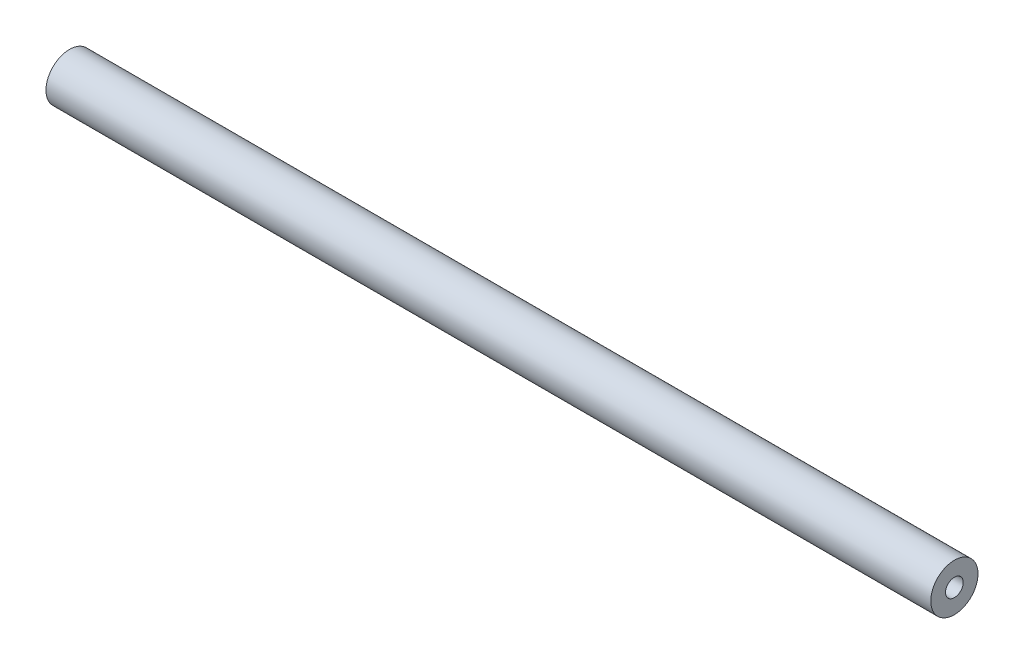
ISO-10303-21;
HEADER;
FILE_DESCRIPTION(('STEP AP214'),'2;1');
FILE_NAME('part.step','',(''),(''),'','','');
FILE_SCHEMA(('AUTOMOTIVE_DESIGN { 1 0 10303 214 1 1 1 1 }'));
ENDSEC;
DATA;
#1=APPLICATION_CONTEXT('core data for automotive mechanical design processes');
#2=APPLICATION_PROTOCOL_DEFINITION('international standard','automotive_design',2000,#1);
#3=PRODUCT_CONTEXT('',#1,'mechanical');
#4=PRODUCT('Part','Part','',(#3));
#5=PRODUCT_RELATED_PRODUCT_CATEGORY('part','',(#4));
#6=PRODUCT_DEFINITION_FORMATION('','',#4);
#7=PRODUCT_DEFINITION_CONTEXT('part definition',#1,'design');
#8=PRODUCT_DEFINITION('design','',#6,#7);
#9=PRODUCT_DEFINITION_SHAPE('','',#8);
#10=(LENGTH_UNIT() NAMED_UNIT(*) SI_UNIT(.MILLI.,.METRE.));
#11=(NAMED_UNIT(*) PLANE_ANGLE_UNIT() SI_UNIT($,.RADIAN.));
#12=(NAMED_UNIT(*) SI_UNIT($,.STERADIAN.) SOLID_ANGLE_UNIT());
#13=UNCERTAINTY_MEASURE_WITH_UNIT(LENGTH_MEASURE(1.E-05),#10,'distance_accuracy_value','');
#14=(GEOMETRIC_REPRESENTATION_CONTEXT(3) GLOBAL_UNCERTAINTY_ASSIGNED_CONTEXT((#13)) GLOBAL_UNIT_ASSIGNED_CONTEXT((#10,
#11,#12)) REPRESENTATION_CONTEXT('',''));
#15=CARTESIAN_POINT('',(0.,0.,0.));
#16=DIRECTION('',(0.,0.,1.));
#17=DIRECTION('',(1.,0.,0.));
#18=AXIS2_PLACEMENT_3D('',#15,#16,#17);
#19=CARTESIAN_POINT('',(0.,0.,0.));
#20=DIRECTION('',(1.,0.,0.));
#21=DIRECTION('',(0.,0.,-1.));
#22=AXIS2_PLACEMENT_3D('',#19,#20,#21);
#23=CYLINDRICAL_SURFACE('',#22,1.5);
#24=CARTESIAN_POINT('',(149.86,0.,0.));
#25=DIRECTION('',(1.,0.,0.));
#26=DIRECTION('',(0.,0.,-1.));
#27=AXIS2_PLACEMENT_3D('',#24,#25,#26);
#28=CIRCLE('',#27,1.5);
#29=CARTESIAN_POINT('',(149.86,0.,-1.5));
#30=VERTEX_POINT('',#29);
#31=EDGE_CURVE('E19',#30,#30,#28,.F.);
#32=ORIENTED_EDGE('',*,*,#31,.F.);
#33=EDGE_LOOP('',(#32));
#34=FACE_BOUND('',#33,.T.);
#35=CARTESIAN_POINT('',(0.,0.,0.));
#36=DIRECTION('',(1.,0.,0.));
#37=DIRECTION('',(0.,0.,-1.));
#38=AXIS2_PLACEMENT_3D('',#35,#36,#37);
#39=CIRCLE('',#38,1.5);
#40=CARTESIAN_POINT('',(0.,0.,-1.5));
#41=VERTEX_POINT('',#40);
#42=EDGE_CURVE('E27',#41,#41,#39,.F.);
#43=ORIENTED_EDGE('',*,*,#42,.T.);
#44=EDGE_LOOP('',(#43));
#45=FACE_BOUND('',#44,.T.);
#46=ADVANCED_FACE('F16',(#34,#45),#23,.F.);
#47=CARTESIAN_POINT('',(149.86,0.,0.));
#48=DIRECTION('',(1.,0.,0.));
#49=DIRECTION('',(0.,0.,-1.));
#50=AXIS2_PLACEMENT_3D('',#47,#48,#49);
#51=PLANE('',#50);
#52=ORIENTED_EDGE('',*,*,#31,.T.);
#53=EDGE_LOOP('',(#52));
#54=FACE_BOUND('',#53,.T.);
#55=CARTESIAN_POINT('',(149.86,0.,0.));
#56=DIRECTION('',(1.,0.,0.));
#57=DIRECTION('',(0.,0.,-1.));
#58=AXIS2_PLACEMENT_3D('',#55,#56,#57);
#59=CIRCLE('',#58,4.);
#60=CARTESIAN_POINT('',(149.86,0.,-4.));
#61=VERTEX_POINT('',#60);
#62=EDGE_CURVE('E23',#61,#61,#59,.F.);
#63=ORIENTED_EDGE('',*,*,#62,.F.);
#64=EDGE_LOOP('',(#63));
#65=FACE_BOUND('',#64,.T.);
#66=ADVANCED_FACE('F36',(#54,#65),#51,.T.);
#67=CARTESIAN_POINT('',(0.,0.,0.));
#68=DIRECTION('',(1.,0.,0.));
#69=DIRECTION('',(0.,0.,-1.));
#70=AXIS2_PLACEMENT_3D('',#67,#68,#69);
#71=PLANE('',#70);
#72=ORIENTED_EDGE('',*,*,#42,.F.);
#73=EDGE_LOOP('',(#72));
#74=FACE_BOUND('',#73,.T.);
#75=CARTESIAN_POINT('',(0.,0.,0.));
#76=DIRECTION('',(1.,0.,0.));
#77=DIRECTION('',(0.,0.,-1.));
#78=AXIS2_PLACEMENT_3D('',#75,#76,#77);
#79=CIRCLE('',#78,4.);
#80=CARTESIAN_POINT('',(0.,0.,-4.));
#81=VERTEX_POINT('',#80);
#82=EDGE_CURVE('E11',#81,#81,#79,.T.);
#83=ORIENTED_EDGE('',*,*,#82,.F.);
#84=EDGE_LOOP('',(#83));
#85=FACE_BOUND('',#84,.T.);
#86=ADVANCED_FACE('F44',(#74,#85),#71,.F.);
#87=CARTESIAN_POINT('',(0.,0.,0.));
#88=DIRECTION('',(1.,0.,0.));
#89=DIRECTION('',(0.,0.,-1.));
#90=AXIS2_PLACEMENT_3D('',#87,#88,#89);
#91=CYLINDRICAL_SURFACE('',#90,4.);
#92=ORIENTED_EDGE('',*,*,#62,.T.);
#93=EDGE_LOOP('',(#92));
#94=FACE_BOUND('',#93,.T.);
#95=ORIENTED_EDGE('',*,*,#82,.T.);
#96=EDGE_LOOP('',(#95));
#97=FACE_BOUND('',#96,.T.);
#98=ADVANCED_FACE('F45',(#94,#97),#91,.T.);
#99=CLOSED_SHELL('',(#46,#66,#86,#98));
#100=MANIFOLD_SOLID_BREP('B1',#99);
#101=ADVANCED_BREP_SHAPE_REPRESENTATION('',(#18,#100),#14);
#102=SHAPE_DEFINITION_REPRESENTATION(#9,#101);
ENDSEC;
END-ISO-10303-21;
